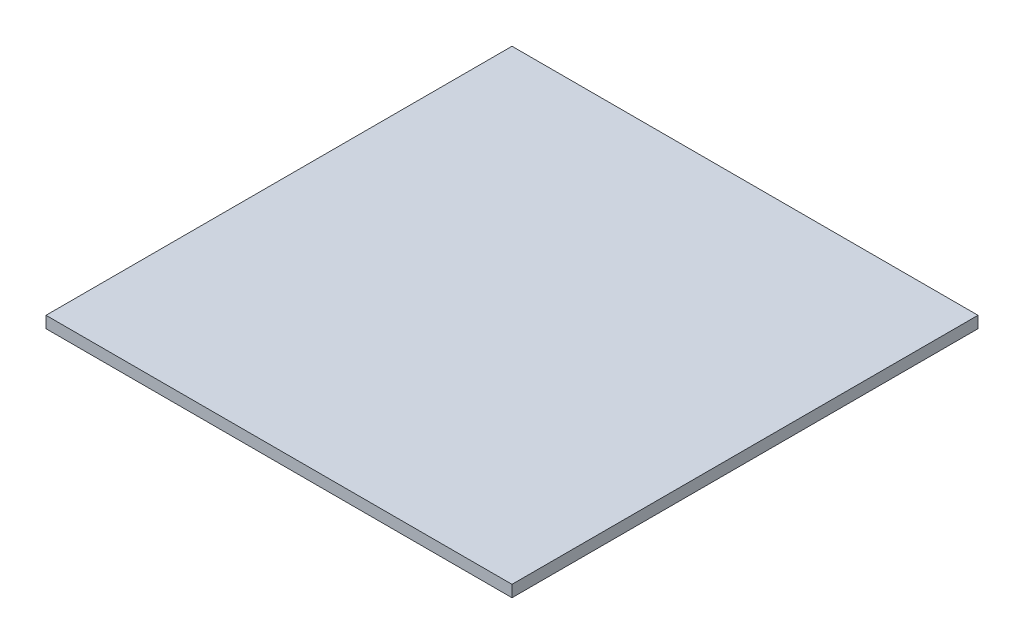
ISO-10303-21;
HEADER;
FILE_DESCRIPTION(('STEP AP214'),'2;1');
FILE_NAME('part.step','',(''),(''),'','','');
FILE_SCHEMA(('AUTOMOTIVE_DESIGN { 1 0 10303 214 1 1 1 1 }'));
ENDSEC;
DATA;
#1=APPLICATION_CONTEXT('core data for automotive mechanical design processes');
#2=APPLICATION_PROTOCOL_DEFINITION('international standard','automotive_design',2000,#1);
#3=PRODUCT_CONTEXT('',#1,'mechanical');
#4=PRODUCT('Part','Part','',(#3));
#5=PRODUCT_RELATED_PRODUCT_CATEGORY('part','',(#4));
#6=PRODUCT_DEFINITION_FORMATION('','',#4);
#7=PRODUCT_DEFINITION_CONTEXT('part definition',#1,'design');
#8=PRODUCT_DEFINITION('design','',#6,#7);
#9=PRODUCT_DEFINITION_SHAPE('','',#8);
#10=(LENGTH_UNIT() NAMED_UNIT(*) SI_UNIT(.MILLI.,.METRE.));
#11=(NAMED_UNIT(*) PLANE_ANGLE_UNIT() SI_UNIT($,.RADIAN.));
#12=(NAMED_UNIT(*) SI_UNIT($,.STERADIAN.) SOLID_ANGLE_UNIT());
#13=UNCERTAINTY_MEASURE_WITH_UNIT(LENGTH_MEASURE(1.E-05),#10,'distance_accuracy_value','');
#14=(GEOMETRIC_REPRESENTATION_CONTEXT(3) GLOBAL_UNCERTAINTY_ASSIGNED_CONTEXT((#13)) GLOBAL_UNIT_ASSIGNED_CONTEXT((#10,
#11,#12)) REPRESENTATION_CONTEXT('',''));
#15=CARTESIAN_POINT('',(0.,0.,0.));
#16=DIRECTION('',(0.,0.,1.));
#17=DIRECTION('',(1.,0.,0.));
#18=AXIS2_PLACEMENT_3D('',#15,#16,#17);
#19=CARTESIAN_POINT('',(15.,2.,-40.));
#20=DIRECTION('',(-1.,0.,0.));
#21=DIRECTION('',(0.,0.,1.));
#22=AXIS2_PLACEMENT_3D('',#19,#20,#21);
#23=PLANE('',#22);
#24=DIRECTION('',(0.,0.,-1.));
#25=VECTOR('',#24,1.);
#26=CARTESIAN_POINT('',(15.,0.,-40.));
#27=LINE('',#26,#25);
#28=CARTESIAN_POINT('',(15.,0.,40.));
#29=VERTEX_POINT('',#28);
#30=CARTESIAN_POINT('',(15.,0.,-40.));
#31=VERTEX_POINT('',#30);
#32=EDGE_CURVE('E81',#29,#31,#27,.T.);
#33=ORIENTED_EDGE('',*,*,#32,.T.);
#34=DIRECTION('',(0.,-1.,0.));
#35=VECTOR('',#34,1.);
#36=CARTESIAN_POINT('',(15.,2.,-40.));
#37=LINE('',#36,#35);
#38=CARTESIAN_POINT('',(15.,2.,-40.));
#39=VERTEX_POINT('',#38);
#40=EDGE_CURVE('E11',#39,#31,#37,.T.);
#41=ORIENTED_EDGE('',*,*,#40,.F.);
#42=DIRECTION('',(0.,0.,-1.));
#43=VECTOR('',#42,1.);
#44=CARTESIAN_POINT('',(15.,2.,-40.));
#45=LINE('',#44,#43);
#46=CARTESIAN_POINT('',(15.,2.,40.));
#47=VERTEX_POINT('',#46);
#48=EDGE_CURVE('E97',#47,#39,#45,.T.);
#49=ORIENTED_EDGE('',*,*,#48,.F.);
#50=DIRECTION('',(0.,-1.,0.));
#51=VECTOR('',#50,1.);
#52=CARTESIAN_POINT('',(15.,2.,40.));
#53=LINE('',#52,#51);
#54=EDGE_CURVE('E41',#47,#29,#53,.T.);
#55=ORIENTED_EDGE('',*,*,#54,.T.);
#56=EDGE_LOOP('',(#33,#41,#49,#55));
#57=FACE_BOUND('',#56,.T.);
#58=ADVANCED_FACE('F33',(#57),#23,.F.);
#59=CARTESIAN_POINT('',(-15.,2.,-40.));
#60=DIRECTION('',(0.,0.,1.));
#61=DIRECTION('',(1.,0.,0.));
#62=AXIS2_PLACEMENT_3D('',#59,#60,#61);
#63=PLANE('',#62);
#64=DIRECTION('',(-1.,0.,0.));
#65=VECTOR('',#64,1.);
#66=CARTESIAN_POINT('',(-15.,0.,-40.));
#67=LINE('',#66,#65);
#68=CARTESIAN_POINT('',(-65.,0.,-40.));
#69=VERTEX_POINT('',#68);
#70=EDGE_CURVE('E61',#31,#69,#67,.T.);
#71=ORIENTED_EDGE('',*,*,#70,.T.);
#72=DIRECTION('',(0.,-1.,0.));
#73=VECTOR('',#72,1.);
#74=CARTESIAN_POINT('',(-65.,2.,-40.));
#75=LINE('',#74,#73);
#76=CARTESIAN_POINT('',(-65.,2.,-40.));
#77=VERTEX_POINT('',#76);
#78=EDGE_CURVE('E77',#77,#69,#75,.T.);
#79=ORIENTED_EDGE('',*,*,#78,.F.);
#80=DIRECTION('',(-1.,0.,0.));
#81=VECTOR('',#80,1.);
#82=CARTESIAN_POINT('',(-15.,2.,-40.));
#83=LINE('',#82,#81);
#84=EDGE_CURVE('E65',#39,#77,#83,.T.);
#85=ORIENTED_EDGE('',*,*,#84,.F.);
#86=ORIENTED_EDGE('',*,*,#40,.T.);
#87=EDGE_LOOP('',(#71,#79,#85,#86));
#88=FACE_BOUND('',#87,.T.);
#89=ADVANCED_FACE('F75',(#88),#63,.F.);
#90=CARTESIAN_POINT('',(-15.,2.,40.));
#91=DIRECTION('',(0.,0.,-1.));
#92=DIRECTION('',(-1.,0.,0.));
#93=AXIS2_PLACEMENT_3D('',#90,#91,#92);
#94=PLANE('',#93);
#95=DIRECTION('',(1.,0.,0.));
#96=VECTOR('',#95,1.);
#97=CARTESIAN_POINT('',(-15.,0.,40.));
#98=LINE('',#97,#96);
#99=CARTESIAN_POINT('',(-65.,0.,40.));
#100=VERTEX_POINT('',#99);
#101=EDGE_CURVE('E80',#100,#29,#98,.T.);
#102=ORIENTED_EDGE('',*,*,#101,.T.);
#103=ORIENTED_EDGE('',*,*,#54,.F.);
#104=DIRECTION('',(1.,0.,0.));
#105=VECTOR('',#104,1.);
#106=CARTESIAN_POINT('',(-15.,2.,40.));
#107=LINE('',#106,#105);
#108=CARTESIAN_POINT('',(-65.,2.,40.));
#109=VERTEX_POINT('',#108);
#110=EDGE_CURVE('E49',#109,#47,#107,.T.);
#111=ORIENTED_EDGE('',*,*,#110,.F.);
#112=DIRECTION('',(0.,1.,0.));
#113=VECTOR('',#112,1.);
#114=CARTESIAN_POINT('',(-65.,0.,40.));
#115=LINE('',#114,#113);
#116=EDGE_CURVE('E89',#100,#109,#115,.T.);
#117=ORIENTED_EDGE('',*,*,#116,.F.);
#118=EDGE_LOOP('',(#102,#103,#111,#117));
#119=FACE_BOUND('',#118,.T.);
#120=ADVANCED_FACE('F106',(#119),#94,.F.);
#121=CARTESIAN_POINT('',(0.,2.,0.));
#122=DIRECTION('',(0.,1.,0.));
#123=DIRECTION('',(0.,0.,1.));
#124=AXIS2_PLACEMENT_3D('',#121,#122,#123);
#125=PLANE('',#124);
#126=ORIENTED_EDGE('',*,*,#48,.T.);
#127=ORIENTED_EDGE('',*,*,#84,.T.);
#128=DIRECTION('',(0.,0.,-1.));
#129=VECTOR('',#128,1.);
#130=CARTESIAN_POINT('',(-65.,2.,40.));
#131=LINE('',#130,#129);
#132=EDGE_CURVE('E92',#109,#77,#131,.T.);
#133=ORIENTED_EDGE('',*,*,#132,.F.);
#134=ORIENTED_EDGE('',*,*,#110,.T.);
#135=EDGE_LOOP('',(#126,#127,#133,#134));
#136=FACE_BOUND('',#135,.T.);
#137=ADVANCED_FACE('F107',(#136),#125,.T.);
#138=CARTESIAN_POINT('',(0.,0.,0.));
#139=DIRECTION('',(0.,1.,0.));
#140=DIRECTION('',(0.,0.,1.));
#141=AXIS2_PLACEMENT_3D('',#138,#139,#140);
#142=PLANE('',#141);
#143=ORIENTED_EDGE('',*,*,#32,.F.);
#144=ORIENTED_EDGE('',*,*,#101,.F.);
#145=DIRECTION('',(0.,0.,1.));
#146=VECTOR('',#145,1.);
#147=CARTESIAN_POINT('',(-65.,0.,-40.));
#148=LINE('',#147,#146);
#149=EDGE_CURVE('E84',#69,#100,#148,.T.);
#150=ORIENTED_EDGE('',*,*,#149,.F.);
#151=ORIENTED_EDGE('',*,*,#70,.F.);
#152=EDGE_LOOP('',(#143,#144,#150,#151));
#153=FACE_BOUND('',#152,.T.);
#154=ADVANCED_FACE('F85',(#153),#142,.F.);
#155=CARTESIAN_POINT('',(-65.,0.,0.));
#156=DIRECTION('',(-1.,0.,0.));
#157=DIRECTION('',(0.,0.,1.));
#158=AXIS2_PLACEMENT_3D('',#155,#156,#157);
#159=PLANE('',#158);
#160=ORIENTED_EDGE('',*,*,#78,.T.);
#161=ORIENTED_EDGE('',*,*,#149,.T.);
#162=ORIENTED_EDGE('',*,*,#116,.T.);
#163=ORIENTED_EDGE('',*,*,#132,.T.);
#164=EDGE_LOOP('',(#160,#161,#162,#163));
#165=FACE_BOUND('',#164,.T.);
#166=ADVANCED_FACE('F91',(#165),#159,.T.);
#167=CLOSED_SHELL('',(#58,#89,#120,#137,#154,#166));
#168=MANIFOLD_SOLID_BREP('B2',#167);
#169=ADVANCED_BREP_SHAPE_REPRESENTATION('',(#18,#168),#14);
#170=SHAPE_DEFINITION_REPRESENTATION(#9,#169);
ENDSEC;
END-ISO-10303-21;
